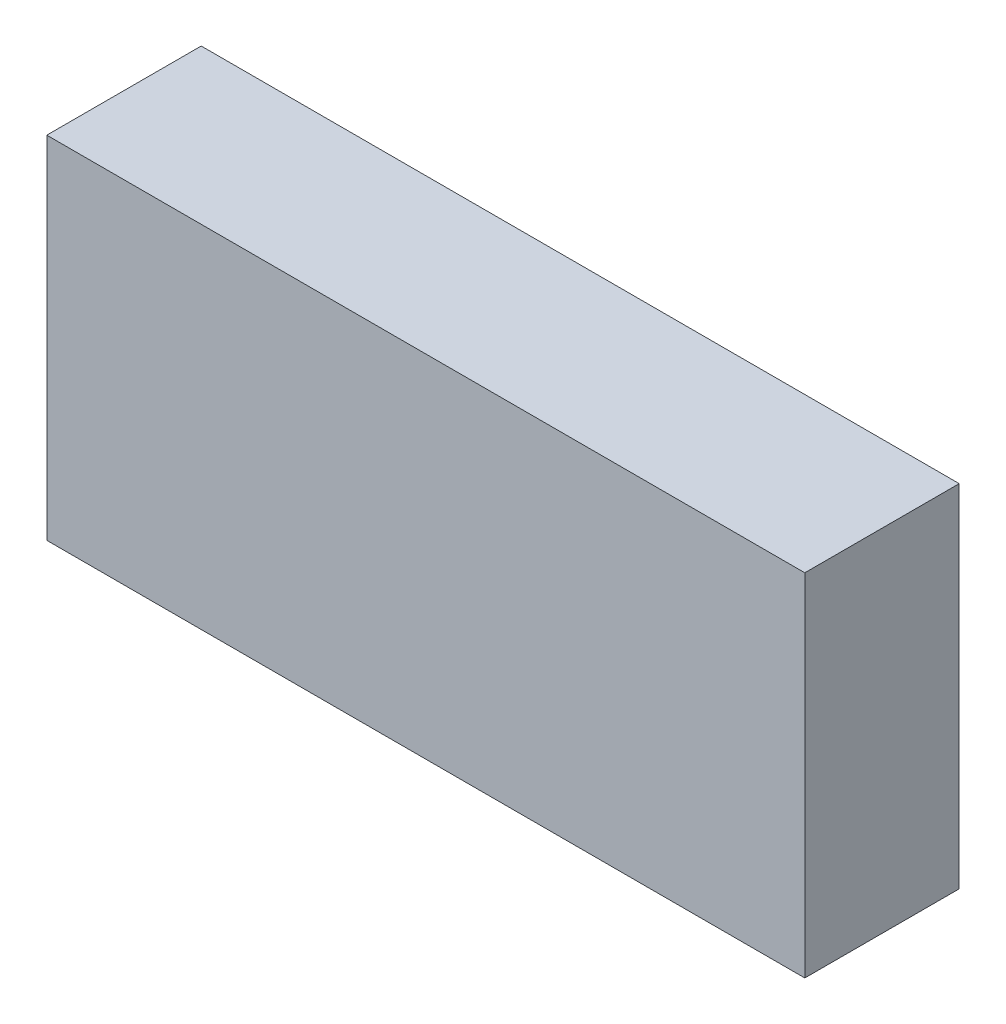
ISO-10303-21;
HEADER;
FILE_DESCRIPTION(('STEP AP214'),'2;1');
FILE_NAME('part.step','',(''),(''),'','','');
FILE_SCHEMA(('AUTOMOTIVE_DESIGN { 1 0 10303 214 1 1 1 1 }'));
ENDSEC;
DATA;
#1=APPLICATION_CONTEXT('core data for automotive mechanical design processes');
#2=APPLICATION_PROTOCOL_DEFINITION('international standard','automotive_design',2000,#1);
#3=PRODUCT_CONTEXT('',#1,'mechanical');
#4=PRODUCT('Part','Part','',(#3));
#5=PRODUCT_RELATED_PRODUCT_CATEGORY('part','',(#4));
#6=PRODUCT_DEFINITION_FORMATION('','',#4);
#7=PRODUCT_DEFINITION_CONTEXT('part definition',#1,'design');
#8=PRODUCT_DEFINITION('design','',#6,#7);
#9=PRODUCT_DEFINITION_SHAPE('','',#8);
#10=(LENGTH_UNIT() NAMED_UNIT(*) SI_UNIT(.MILLI.,.METRE.));
#11=(NAMED_UNIT(*) PLANE_ANGLE_UNIT() SI_UNIT($,.RADIAN.));
#12=(NAMED_UNIT(*) SI_UNIT($,.STERADIAN.) SOLID_ANGLE_UNIT());
#13=UNCERTAINTY_MEASURE_WITH_UNIT(LENGTH_MEASURE(1.E-05),#10,'distance_accuracy_value','');
#14=(GEOMETRIC_REPRESENTATION_CONTEXT(3) GLOBAL_UNCERTAINTY_ASSIGNED_CONTEXT((#13)) GLOBAL_UNIT_ASSIGNED_CONTEXT((#10,
#11,#12)) REPRESENTATION_CONTEXT('',''));
#15=CARTESIAN_POINT('',(0.,0.,0.));
#16=DIRECTION('',(0.,0.,1.));
#17=DIRECTION('',(1.,0.,0.));
#18=AXIS2_PLACEMENT_3D('',#15,#16,#17);
#19=CARTESIAN_POINT('',(0.,0.,11.));
#20=DIRECTION('',(1.,0.,0.));
#21=DIRECTION('',(0.,1.,0.));
#22=AXIS2_PLACEMENT_3D('',#19,#20,#21);
#23=PLANE('',#22);
#24=DIRECTION('',(0.,-1.,0.));
#25=VECTOR('',#24,1.);
#26=CARTESIAN_POINT('',(0.,0.,0.));
#27=LINE('',#26,#25);
#28=CARTESIAN_POINT('',(0.,0.,0.));
#29=VERTEX_POINT('',#28);
#30=CARTESIAN_POINT('',(0.,-25.,0.));
#31=VERTEX_POINT('',#30);
#32=EDGE_CURVE('E100',#29,#31,#27,.T.);
#33=ORIENTED_EDGE('',*,*,#32,.T.);
#34=DIRECTION('',(0.,0.,-1.));
#35=VECTOR('',#34,1.);
#36=CARTESIAN_POINT('',(0.,-25.,11.));
#37=LINE('',#36,#35);
#38=CARTESIAN_POINT('',(0.,-25.,11.));
#39=VERTEX_POINT('',#38);
#40=EDGE_CURVE('E11',#39,#31,#37,.T.);
#41=ORIENTED_EDGE('',*,*,#40,.F.);
#42=DIRECTION('',(0.,-1.,0.));
#43=VECTOR('',#42,1.);
#44=CARTESIAN_POINT('',(0.,0.,11.));
#45=LINE('',#44,#43);
#46=CARTESIAN_POINT('',(0.,0.,11.));
#47=VERTEX_POINT('',#46);
#48=EDGE_CURVE('E88',#47,#39,#45,.T.);
#49=ORIENTED_EDGE('',*,*,#48,.F.);
#50=DIRECTION('',(0.,0.,-1.));
#51=VECTOR('',#50,1.);
#52=CARTESIAN_POINT('',(0.,0.,11.));
#53=LINE('',#52,#51);
#54=EDGE_CURVE('E96',#47,#29,#53,.T.);
#55=ORIENTED_EDGE('',*,*,#54,.T.);
#56=EDGE_LOOP('',(#33,#41,#49,#55));
#57=FACE_BOUND('',#56,.T.);
#58=ADVANCED_FACE('F37',(#57),#23,.F.);
#59=CARTESIAN_POINT('',(0.,-25.,11.));
#60=DIRECTION('',(0.,1.,0.));
#61=DIRECTION('',(0.,0.,1.));
#62=AXIS2_PLACEMENT_3D('',#59,#60,#61);
#63=PLANE('',#62);
#64=DIRECTION('',(1.,0.,0.));
#65=VECTOR('',#64,1.);
#66=CARTESIAN_POINT('',(0.,-25.,0.));
#67=LINE('',#66,#65);
#68=CARTESIAN_POINT('',(54.,-25.,0.));
#69=VERTEX_POINT('',#68);
#70=EDGE_CURVE('E92',#31,#69,#67,.T.);
#71=ORIENTED_EDGE('',*,*,#70,.T.);
#72=DIRECTION('',(0.,0.,-1.));
#73=VECTOR('',#72,1.);
#74=CARTESIAN_POINT('',(54.,-25.,11.));
#75=LINE('',#74,#73);
#76=CARTESIAN_POINT('',(54.,-25.,11.));
#77=VERTEX_POINT('',#76);
#78=EDGE_CURVE('E45',#77,#69,#75,.T.);
#79=ORIENTED_EDGE('',*,*,#78,.F.);
#80=DIRECTION('',(1.,0.,0.));
#81=VECTOR('',#80,1.);
#82=CARTESIAN_POINT('',(0.,-25.,11.));
#83=LINE('',#82,#81);
#84=EDGE_CURVE('E83',#39,#77,#83,.T.);
#85=ORIENTED_EDGE('',*,*,#84,.F.);
#86=ORIENTED_EDGE('',*,*,#40,.T.);
#87=EDGE_LOOP('',(#71,#79,#85,#86));
#88=FACE_BOUND('',#87,.T.);
#89=ADVANCED_FACE('F91',(#88),#63,.F.);
#90=CARTESIAN_POINT('',(54.,0.,11.));
#91=DIRECTION('',(-1.,0.,0.));
#92=DIRECTION('',(0.,0.,1.));
#93=AXIS2_PLACEMENT_3D('',#90,#91,#92);
#94=PLANE('',#93);
#95=DIRECTION('',(0.,1.,0.));
#96=VECTOR('',#95,1.);
#97=CARTESIAN_POINT('',(54.,0.,0.));
#98=LINE('',#97,#96);
#99=CARTESIAN_POINT('',(54.,0.,0.));
#100=VERTEX_POINT('',#99);
#101=EDGE_CURVE('E70',#69,#100,#98,.T.);
#102=ORIENTED_EDGE('',*,*,#101,.T.);
#103=DIRECTION('',(0.,0.,-1.));
#104=VECTOR('',#103,1.);
#105=CARTESIAN_POINT('',(54.,0.,11.));
#106=LINE('',#105,#104);
#107=CARTESIAN_POINT('',(54.,0.,11.));
#108=VERTEX_POINT('',#107);
#109=EDGE_CURVE('E93',#108,#100,#106,.T.);
#110=ORIENTED_EDGE('',*,*,#109,.F.);
#111=DIRECTION('',(0.,1.,0.));
#112=VECTOR('',#111,1.);
#113=CARTESIAN_POINT('',(54.,0.,11.));
#114=LINE('',#113,#112);
#115=EDGE_CURVE('E86',#77,#108,#114,.T.);
#116=ORIENTED_EDGE('',*,*,#115,.F.);
#117=ORIENTED_EDGE('',*,*,#78,.T.);
#118=EDGE_LOOP('',(#102,#110,#116,#117));
#119=FACE_BOUND('',#118,.T.);
#120=ADVANCED_FACE('F94',(#119),#94,.F.);
#121=CARTESIAN_POINT('',(0.,0.,11.));
#122=DIRECTION('',(0.,-1.,0.));
#123=DIRECTION('',(0.,0.,-1.));
#124=AXIS2_PLACEMENT_3D('',#121,#122,#123);
#125=PLANE('',#124);
#126=DIRECTION('',(-1.,0.,0.));
#127=VECTOR('',#126,1.);
#128=CARTESIAN_POINT('',(0.,0.,0.));
#129=LINE('',#128,#127);
#130=EDGE_CURVE('E76',#100,#29,#129,.T.);
#131=ORIENTED_EDGE('',*,*,#130,.T.);
#132=ORIENTED_EDGE('',*,*,#54,.F.);
#133=DIRECTION('',(-1.,0.,0.));
#134=VECTOR('',#133,1.);
#135=CARTESIAN_POINT('',(0.,0.,11.));
#136=LINE('',#135,#134);
#137=EDGE_CURVE('E53',#108,#47,#136,.T.);
#138=ORIENTED_EDGE('',*,*,#137,.F.);
#139=ORIENTED_EDGE('',*,*,#109,.T.);
#140=EDGE_LOOP('',(#131,#132,#138,#139));
#141=FACE_BOUND('',#140,.T.);
#142=ADVANCED_FACE('F107',(#141),#125,.F.);
#143=CARTESIAN_POINT('',(0.,0.,11.));
#144=DIRECTION('',(0.,0.,1.));
#145=DIRECTION('',(1.,0.,0.));
#146=AXIS2_PLACEMENT_3D('',#143,#144,#145);
#147=PLANE('',#146);
#148=ORIENTED_EDGE('',*,*,#48,.T.);
#149=ORIENTED_EDGE('',*,*,#84,.T.);
#150=ORIENTED_EDGE('',*,*,#115,.T.);
#151=ORIENTED_EDGE('',*,*,#137,.T.);
#152=EDGE_LOOP('',(#148,#149,#150,#151));
#153=FACE_BOUND('',#152,.T.);
#154=ADVANCED_FACE('F84',(#153),#147,.T.);
#155=CARTESIAN_POINT('',(0.,0.,0.));
#156=DIRECTION('',(0.,0.,1.));
#157=DIRECTION('',(1.,0.,0.));
#158=AXIS2_PLACEMENT_3D('',#155,#156,#157);
#159=PLANE('',#158);
#160=ORIENTED_EDGE('',*,*,#32,.F.);
#161=ORIENTED_EDGE('',*,*,#130,.F.);
#162=ORIENTED_EDGE('',*,*,#101,.F.);
#163=ORIENTED_EDGE('',*,*,#70,.F.);
#164=EDGE_LOOP('',(#160,#161,#162,#163));
#165=FACE_BOUND('',#164,.T.);
#166=ADVANCED_FACE('F110',(#165),#159,.F.);
#167=CLOSED_SHELL('',(#58,#89,#120,#142,#154,#166));
#168=MANIFOLD_SOLID_BREP('B2',#167);
#169=ADVANCED_BREP_SHAPE_REPRESENTATION('',(#18,#168),#14);
#170=SHAPE_DEFINITION_REPRESENTATION(#9,#169);
ENDSEC;
END-ISO-10303-21;
